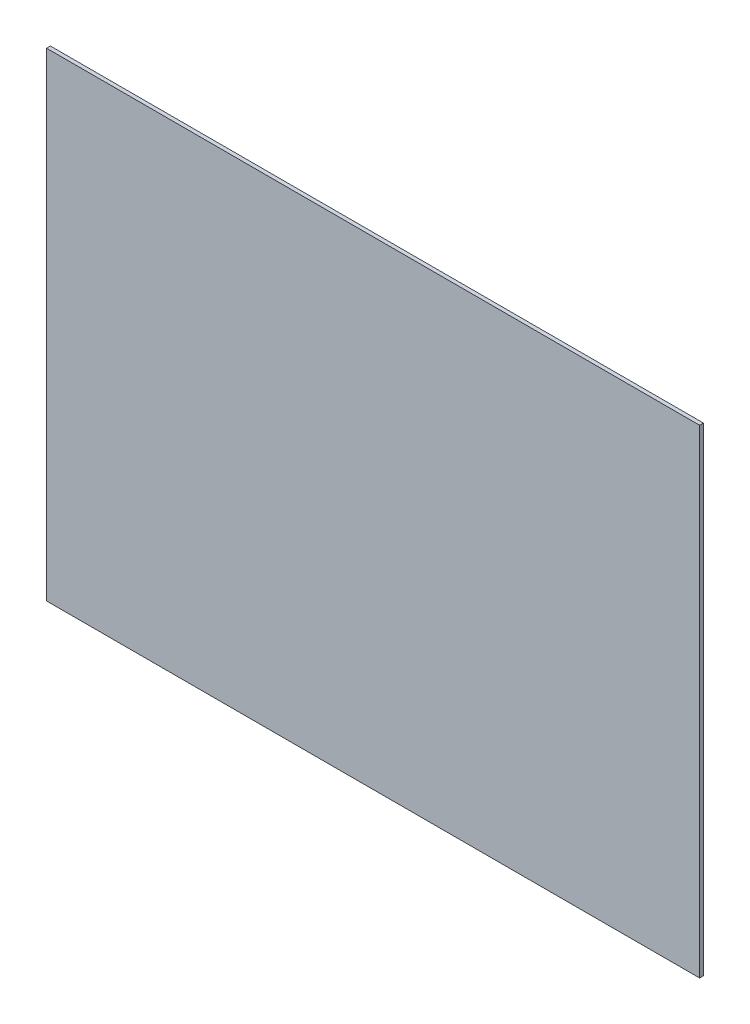
ISO-10303-21;
HEADER;
FILE_DESCRIPTION(('STEP AP214'),'2;1');
FILE_NAME('part.step','',(''),(''),'','','');
FILE_SCHEMA(('AUTOMOTIVE_DESIGN { 1 0 10303 214 1 1 1 1 }'));
ENDSEC;
DATA;
#1=APPLICATION_CONTEXT('core data for automotive mechanical design processes');
#2=APPLICATION_PROTOCOL_DEFINITION('international standard','automotive_design',2000,#1);
#3=PRODUCT_CONTEXT('',#1,'mechanical');
#4=PRODUCT('Part','Part','',(#3));
#5=PRODUCT_RELATED_PRODUCT_CATEGORY('part','',(#4));
#6=PRODUCT_DEFINITION_FORMATION('','',#4);
#7=PRODUCT_DEFINITION_CONTEXT('part definition',#1,'design');
#8=PRODUCT_DEFINITION('design','',#6,#7);
#9=PRODUCT_DEFINITION_SHAPE('','',#8);
#10=(LENGTH_UNIT() NAMED_UNIT(*) SI_UNIT(.MILLI.,.METRE.));
#11=(NAMED_UNIT(*) PLANE_ANGLE_UNIT() SI_UNIT($,.RADIAN.));
#12=(NAMED_UNIT(*) SI_UNIT($,.STERADIAN.) SOLID_ANGLE_UNIT());
#13=UNCERTAINTY_MEASURE_WITH_UNIT(LENGTH_MEASURE(1.E-05),#10,'distance_accuracy_value','');
#14=(GEOMETRIC_REPRESENTATION_CONTEXT(3) GLOBAL_UNCERTAINTY_ASSIGNED_CONTEXT((#13)) GLOBAL_UNIT_ASSIGNED_CONTEXT((#10,
#11,#12)) REPRESENTATION_CONTEXT('',''));
#15=CARTESIAN_POINT('',(0.,0.,0.));
#16=DIRECTION('',(0.,0.,1.));
#17=DIRECTION('',(1.,0.,0.));
#18=AXIS2_PLACEMENT_3D('',#15,#16,#17);
#19=CARTESIAN_POINT('',(136.525,100.076,1.6002));
#20=DIRECTION('',(-1.,0.,0.));
#21=DIRECTION('',(0.,-1.,0.));
#22=AXIS2_PLACEMENT_3D('',#19,#20,#21);
#23=PLANE('',#22);
#24=DIRECTION('',(0.,1.,0.));
#25=VECTOR('',#24,1.);
#26=CARTESIAN_POINT('',(136.525,100.076,0.));
#27=LINE('',#26,#25);
#28=CARTESIAN_POINT('',(136.525,-100.076,0.));
#29=VERTEX_POINT('',#28);
#30=CARTESIAN_POINT('',(136.525,100.076,0.));
#31=VERTEX_POINT('',#30);
#32=EDGE_CURVE('E100',#29,#31,#27,.T.);
#33=ORIENTED_EDGE('',*,*,#32,.T.);
#34=DIRECTION('',(0.,0.,-1.));
#35=VECTOR('',#34,1.);
#36=CARTESIAN_POINT('',(136.525,100.076,1.6002));
#37=LINE('',#36,#35);
#38=CARTESIAN_POINT('',(136.525,100.076,1.6002));
#39=VERTEX_POINT('',#38);
#40=EDGE_CURVE('E11',#39,#31,#37,.T.);
#41=ORIENTED_EDGE('',*,*,#40,.F.);
#42=DIRECTION('',(0.,1.,0.));
#43=VECTOR('',#42,1.);
#44=CARTESIAN_POINT('',(136.525,100.076,1.6002));
#45=LINE('',#44,#43);
#46=CARTESIAN_POINT('',(136.525,-100.076,1.6002));
#47=VERTEX_POINT('',#46);
#48=EDGE_CURVE('E88',#47,#39,#45,.T.);
#49=ORIENTED_EDGE('',*,*,#48,.F.);
#50=DIRECTION('',(0.,0.,-1.));
#51=VECTOR('',#50,1.);
#52=CARTESIAN_POINT('',(136.525,-100.076,1.6002));
#53=LINE('',#52,#51);
#54=EDGE_CURVE('E96',#47,#29,#53,.T.);
#55=ORIENTED_EDGE('',*,*,#54,.T.);
#56=EDGE_LOOP('',(#33,#41,#49,#55));
#57=FACE_BOUND('',#56,.T.);
#58=ADVANCED_FACE('F37',(#57),#23,.F.);
#59=CARTESIAN_POINT('',(-136.525,100.076,1.6002));
#60=DIRECTION('',(0.,-1.,0.));
#61=DIRECTION('',(0.,0.,-1.));
#62=AXIS2_PLACEMENT_3D('',#59,#60,#61);
#63=PLANE('',#62);
#64=DIRECTION('',(-1.,0.,0.));
#65=VECTOR('',#64,1.);
#66=CARTESIAN_POINT('',(-136.525,100.076,0.));
#67=LINE('',#66,#65);
#68=CARTESIAN_POINT('',(-136.525,100.076,0.));
#69=VERTEX_POINT('',#68);
#70=EDGE_CURVE('E92',#31,#69,#67,.T.);
#71=ORIENTED_EDGE('',*,*,#70,.T.);
#72=DIRECTION('',(0.,0.,-1.));
#73=VECTOR('',#72,1.);
#74=CARTESIAN_POINT('',(-136.525,100.076,1.6002));
#75=LINE('',#74,#73);
#76=CARTESIAN_POINT('',(-136.525,100.076,1.6002));
#77=VERTEX_POINT('',#76);
#78=EDGE_CURVE('E45',#77,#69,#75,.T.);
#79=ORIENTED_EDGE('',*,*,#78,.F.);
#80=DIRECTION('',(-1.,0.,0.));
#81=VECTOR('',#80,1.);
#82=CARTESIAN_POINT('',(-136.525,100.076,1.6002));
#83=LINE('',#82,#81);
#84=EDGE_CURVE('E83',#39,#77,#83,.T.);
#85=ORIENTED_EDGE('',*,*,#84,.F.);
#86=ORIENTED_EDGE('',*,*,#40,.T.);
#87=EDGE_LOOP('',(#71,#79,#85,#86));
#88=FACE_BOUND('',#87,.T.);
#89=ADVANCED_FACE('F91',(#88),#63,.F.);
#90=CARTESIAN_POINT('',(-136.525,100.076,1.6002));
#91=DIRECTION('',(1.,0.,0.));
#92=DIRECTION('',(0.,1.,0.));
#93=AXIS2_PLACEMENT_3D('',#90,#91,#92);
#94=PLANE('',#93);
#95=DIRECTION('',(0.,-1.,0.));
#96=VECTOR('',#95,1.);
#97=CARTESIAN_POINT('',(-136.525,100.076,0.));
#98=LINE('',#97,#96);
#99=CARTESIAN_POINT('',(-136.525,-100.076,0.));
#100=VERTEX_POINT('',#99);
#101=EDGE_CURVE('E70',#69,#100,#98,.T.);
#102=ORIENTED_EDGE('',*,*,#101,.T.);
#103=DIRECTION('',(0.,0.,-1.));
#104=VECTOR('',#103,1.);
#105=CARTESIAN_POINT('',(-136.525,-100.076,1.6002));
#106=LINE('',#105,#104);
#107=CARTESIAN_POINT('',(-136.525,-100.076,1.6002));
#108=VERTEX_POINT('',#107);
#109=EDGE_CURVE('E93',#108,#100,#106,.T.);
#110=ORIENTED_EDGE('',*,*,#109,.F.);
#111=DIRECTION('',(0.,-1.,0.));
#112=VECTOR('',#111,1.);
#113=CARTESIAN_POINT('',(-136.525,100.076,1.6002));
#114=LINE('',#113,#112);
#115=EDGE_CURVE('E86',#77,#108,#114,.T.);
#116=ORIENTED_EDGE('',*,*,#115,.F.);
#117=ORIENTED_EDGE('',*,*,#78,.T.);
#118=EDGE_LOOP('',(#102,#110,#116,#117));
#119=FACE_BOUND('',#118,.T.);
#120=ADVANCED_FACE('F94',(#119),#94,.F.);
#121=CARTESIAN_POINT('',(-136.525,-100.076,1.6002));
#122=DIRECTION('',(0.,1.,0.));
#123=DIRECTION('',(0.,0.,1.));
#124=AXIS2_PLACEMENT_3D('',#121,#122,#123);
#125=PLANE('',#124);
#126=DIRECTION('',(1.,0.,0.));
#127=VECTOR('',#126,1.);
#128=CARTESIAN_POINT('',(-136.525,-100.076,0.));
#129=LINE('',#128,#127);
#130=EDGE_CURVE('E76',#100,#29,#129,.T.);
#131=ORIENTED_EDGE('',*,*,#130,.T.);
#132=ORIENTED_EDGE('',*,*,#54,.F.);
#133=DIRECTION('',(1.,0.,0.));
#134=VECTOR('',#133,1.);
#135=CARTESIAN_POINT('',(-136.525,-100.076,1.6002));
#136=LINE('',#135,#134);
#137=EDGE_CURVE('E53',#108,#47,#136,.T.);
#138=ORIENTED_EDGE('',*,*,#137,.F.);
#139=ORIENTED_EDGE('',*,*,#109,.T.);
#140=EDGE_LOOP('',(#131,#132,#138,#139));
#141=FACE_BOUND('',#140,.T.);
#142=ADVANCED_FACE('F107',(#141),#125,.F.);
#143=CARTESIAN_POINT('',(0.,0.,1.6002));
#144=DIRECTION('',(0.,0.,1.));
#145=DIRECTION('',(1.,0.,0.));
#146=AXIS2_PLACEMENT_3D('',#143,#144,#145);
#147=PLANE('',#146);
#148=ORIENTED_EDGE('',*,*,#48,.T.);
#149=ORIENTED_EDGE('',*,*,#84,.T.);
#150=ORIENTED_EDGE('',*,*,#115,.T.);
#151=ORIENTED_EDGE('',*,*,#137,.T.);
#152=EDGE_LOOP('',(#148,#149,#150,#151));
#153=FACE_BOUND('',#152,.T.);
#154=ADVANCED_FACE('F84',(#153),#147,.T.);
#155=CARTESIAN_POINT('',(0.,0.,0.));
#156=DIRECTION('',(0.,0.,1.));
#157=DIRECTION('',(1.,0.,0.));
#158=AXIS2_PLACEMENT_3D('',#155,#156,#157);
#159=PLANE('',#158);
#160=ORIENTED_EDGE('',*,*,#32,.F.);
#161=ORIENTED_EDGE('',*,*,#130,.F.);
#162=ORIENTED_EDGE('',*,*,#101,.F.);
#163=ORIENTED_EDGE('',*,*,#70,.F.);
#164=EDGE_LOOP('',(#160,#161,#162,#163));
#165=FACE_BOUND('',#164,.T.);
#166=ADVANCED_FACE('F110',(#165),#159,.F.);
#167=CLOSED_SHELL('',(#58,#89,#120,#142,#154,#166));
#168=MANIFOLD_SOLID_BREP('B2',#167);
#169=ADVANCED_BREP_SHAPE_REPRESENTATION('',(#18,#168),#14);
#170=SHAPE_DEFINITION_REPRESENTATION(#9,#169);
ENDSEC;
END-ISO-10303-21;
